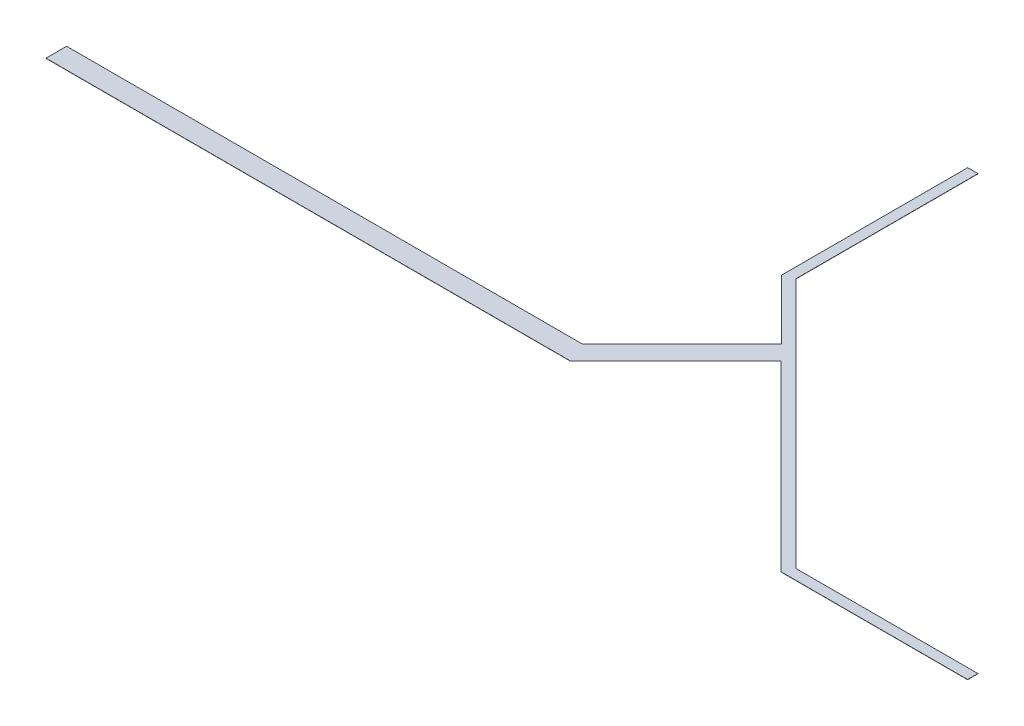
ISO-10303-21;
HEADER;
FILE_DESCRIPTION(('STEP AP214'),'2;1');
FILE_NAME('part.step','',(''),(''),'','','');
FILE_SCHEMA(('AUTOMOTIVE_DESIGN { 1 0 10303 214 1 1 1 1 }'));
ENDSEC;
DATA;
#1=APPLICATION_CONTEXT('core data for automotive mechanical design processes');
#2=APPLICATION_PROTOCOL_DEFINITION('international standard','automotive_design',2000,#1);
#3=PRODUCT_CONTEXT('',#1,'mechanical');
#4=PRODUCT('Part','Part','',(#3));
#5=PRODUCT_RELATED_PRODUCT_CATEGORY('part','',(#4));
#6=PRODUCT_DEFINITION_FORMATION('','',#4);
#7=PRODUCT_DEFINITION_CONTEXT('part definition',#1,'design');
#8=PRODUCT_DEFINITION('design','',#6,#7);
#9=PRODUCT_DEFINITION_SHAPE('','',#8);
#10=(LENGTH_UNIT() NAMED_UNIT(*) SI_UNIT(.MILLI.,.METRE.));
#11=(NAMED_UNIT(*) PLANE_ANGLE_UNIT() SI_UNIT($,.RADIAN.));
#12=(NAMED_UNIT(*) SI_UNIT($,.STERADIAN.) SOLID_ANGLE_UNIT());
#13=UNCERTAINTY_MEASURE_WITH_UNIT(LENGTH_MEASURE(1.E-05),#10,'distance_accuracy_value','');
#14=(GEOMETRIC_REPRESENTATION_CONTEXT(3) GLOBAL_UNCERTAINTY_ASSIGNED_CONTEXT((#13)) GLOBAL_UNIT_ASSIGNED_CONTEXT((#10,
#11,#12)) REPRESENTATION_CONTEXT('',''));
#15=CARTESIAN_POINT('',(0.,0.,0.));
#16=DIRECTION('',(0.,0.,1.));
#17=DIRECTION('',(1.,0.,0.));
#18=AXIS2_PLACEMENT_3D('',#15,#16,#17);
#19=CARTESIAN_POINT('',(22.4783237631845,0.015,-2.01243954632229));
#20=DIRECTION('',(0.,0.,-1.));
#21=DIRECTION('',(-1.,0.,0.));
#22=AXIS2_PLACEMENT_3D('',#19,#20,#21);
#23=PLANE('',#22);
#24=DIRECTION('',(1.,0.,0.));
#25=VECTOR('',#24,1.);
#26=CARTESIAN_POINT('',(22.4783237631845,0.005,-2.01243954632229));
#27=LINE('',#26,#25);
#28=CARTESIAN_POINT('',(22.4783237631845,0.005,-2.01243954632229));
#29=VERTEX_POINT('',#28);
#30=CARTESIAN_POINT('',(47.8933237631845,0.005,-2.01243954632229));
#31=VERTEX_POINT('',#30);
#32=EDGE_CURVE('E167',#29,#31,#27,.T.);
#33=ORIENTED_EDGE('',*,*,#32,.T.);
#34=DIRECTION('',(0.,-1.,0.));
#35=VECTOR('',#34,1.);
#36=CARTESIAN_POINT('',(47.8933237631845,0.015,-2.01243954632229));
#37=LINE('',#36,#35);
#38=CARTESIAN_POINT('',(47.8933237631845,0.015,-2.01243954632229));
#39=VERTEX_POINT('',#38);
#40=EDGE_CURVE('E11',#39,#31,#37,.T.);
#41=ORIENTED_EDGE('',*,*,#40,.F.);
#42=DIRECTION('',(1.,0.,0.));
#43=VECTOR('',#42,1.);
#44=CARTESIAN_POINT('',(22.4783237631845,0.015,-2.01243954632229));
#45=LINE('',#44,#43);
#46=CARTESIAN_POINT('',(22.4783237631845,0.015,-2.01243954632229));
#47=VERTEX_POINT('',#46);
#48=EDGE_CURVE('E193',#47,#39,#45,.T.);
#49=ORIENTED_EDGE('',*,*,#48,.F.);
#50=DIRECTION('',(0.,-1.,0.));
#51=VECTOR('',#50,1.);
#52=CARTESIAN_POINT('',(22.4783237631845,0.015,-2.01243954632229));
#53=LINE('',#52,#51);
#54=EDGE_CURVE('E163',#47,#29,#53,.T.);
#55=ORIENTED_EDGE('',*,*,#54,.T.);
#56=EDGE_LOOP('',(#33,#41,#49,#55));
#57=FACE_BOUND('',#56,.T.);
#58=ADVANCED_FACE('F35',(#57),#23,.F.);
#59=CARTESIAN_POINT('',(47.8933237631845,0.015,-2.01243954632229));
#60=DIRECTION('',(-0.707106781186549,0.,-0.707106781186546));
#61=DIRECTION('',(-0.707106781186546,0.,0.707106781186549));
#62=AXIS2_PLACEMENT_3D('',#59,#60,#61);
#63=PLANE('',#62);
#64=DIRECTION('',(0.707106781186546,0.,-0.707106781186549));
#65=VECTOR('',#64,1.);
#66=CARTESIAN_POINT('',(47.8933237631845,0.005,-2.01243954632229));
#67=LINE('',#66,#65);
#68=CARTESIAN_POINT('',(53.0092413250692,0.005,-7.12835710820697));
#69=VERTEX_POINT('',#68);
#70=EDGE_CURVE('E170',#31,#69,#67,.T.);
#71=ORIENTED_EDGE('',*,*,#70,.T.);
#72=DIRECTION('',(0.,-1.,0.));
#73=VECTOR('',#72,1.);
#74=CARTESIAN_POINT('',(53.0092413250692,0.015,-7.12835710820697));
#75=LINE('',#74,#73);
#76=CARTESIAN_POINT('',(53.0092413250692,0.015,-7.12835710820697));
#77=VERTEX_POINT('',#76);
#78=EDGE_CURVE('E43',#77,#69,#75,.T.);
#79=ORIENTED_EDGE('',*,*,#78,.F.);
#80=DIRECTION('',(0.707106781186546,0.,-0.707106781186549));
#81=VECTOR('',#80,1.);
#82=CARTESIAN_POINT('',(47.8933237631845,0.015,-2.01243954632229));
#83=LINE('',#82,#81);
#84=EDGE_CURVE('E112',#39,#77,#83,.T.);
#85=ORIENTED_EDGE('',*,*,#84,.F.);
#86=ORIENTED_EDGE('',*,*,#40,.T.);
#87=EDGE_LOOP('',(#71,#79,#85,#86));
#88=FACE_BOUND('',#87,.T.);
#89=ADVANCED_FACE('F281',(#88),#63,.F.);
#90=CARTESIAN_POINT('',(53.0092413250692,0.015,-7.12835710820697));
#91=DIRECTION('',(0.707106781186548,0.,-0.707106781186547));
#92=DIRECTION('',(-0.707106781186547,0.,-0.707106781186548));
#93=AXIS2_PLACEMENT_3D('',#90,#91,#92);
#94=PLANE('',#93);
#95=DIRECTION('',(0.707106781186547,0.,0.707106781186548));
#96=VECTOR('',#95,1.);
#97=CARTESIAN_POINT('',(53.0092413250692,0.005,-7.12835710820697));
#98=LINE('',#97,#96);
#99=CARTESIAN_POINT('',(61.8728248272426,0.005,1.73522639396643));
#100=VERTEX_POINT('',#99);
#101=EDGE_CURVE('E172',#69,#100,#98,.T.);
#102=ORIENTED_EDGE('',*,*,#101,.T.);
#103=DIRECTION('',(0.,-1.,0.));
#104=VECTOR('',#103,1.);
#105=CARTESIAN_POINT('',(61.8728248272426,0.015,1.73522639396643));
#106=LINE('',#105,#104);
#107=CARTESIAN_POINT('',(61.8728248272426,0.015,1.73522639396643));
#108=VERTEX_POINT('',#107);
#109=EDGE_CURVE('E218',#108,#100,#106,.T.);
#110=ORIENTED_EDGE('',*,*,#109,.F.);
#111=DIRECTION('',(0.707106781186547,0.,0.707106781186548));
#112=VECTOR('',#111,1.);
#113=CARTESIAN_POINT('',(53.0092413250692,0.015,-7.12835710820697));
#114=LINE('',#113,#112);
#115=EDGE_CURVE('E226',#77,#108,#114,.T.);
#116=ORIENTED_EDGE('',*,*,#115,.F.);
#117=ORIENTED_EDGE('',*,*,#78,.T.);
#118=EDGE_LOOP('',(#102,#110,#116,#117));
#119=FACE_BOUND('',#118,.T.);
#120=ADVANCED_FACE('F224',(#119),#94,.F.);
#121=CARTESIAN_POINT('',(61.8728248272426,0.015,1.73522639396643));
#122=DIRECTION('',(0.,0.,-1.));
#123=DIRECTION('',(-1.,0.,0.));
#124=AXIS2_PLACEMENT_3D('',#121,#122,#123);
#125=PLANE('',#124);
#126=DIRECTION('',(1.,0.,0.));
#127=VECTOR('',#126,1.);
#128=CARTESIAN_POINT('',(61.8728248272426,0.005,1.73522639396643));
#129=LINE('',#128,#127);
#130=CARTESIAN_POINT('',(70.9128248272426,0.005,1.73522639396641));
#131=VERTEX_POINT('',#130);
#132=EDGE_CURVE('E174',#100,#131,#129,.T.);
#133=ORIENTED_EDGE('',*,*,#132,.T.);
#134=DIRECTION('',(0.,-1.,0.));
#135=VECTOR('',#134,1.);
#136=CARTESIAN_POINT('',(70.9128248272426,0.015,1.73522639396641));
#137=LINE('',#136,#135);
#138=CARTESIAN_POINT('',(70.9128248272426,0.015,1.73522639396641));
#139=VERTEX_POINT('',#138);
#140=EDGE_CURVE('E215',#139,#131,#137,.T.);
#141=ORIENTED_EDGE('',*,*,#140,.F.);
#142=DIRECTION('',(1.,0.,0.));
#143=VECTOR('',#142,1.);
#144=CARTESIAN_POINT('',(61.8728248272426,0.015,1.73522639396643));
#145=LINE('',#144,#143);
#146=EDGE_CURVE('E244',#108,#139,#145,.T.);
#147=ORIENTED_EDGE('',*,*,#146,.F.);
#148=ORIENTED_EDGE('',*,*,#109,.T.);
#149=EDGE_LOOP('',(#133,#141,#147,#148));
#150=FACE_BOUND('',#149,.T.);
#151=ADVANCED_FACE('F235',(#150),#125,.F.);
#152=CARTESIAN_POINT('',(70.9128248272426,0.015,1.73522639396641));
#153=DIRECTION('',(-1.,0.,0.));
#154=DIRECTION('',(0.,0.,1.));
#155=AXIS2_PLACEMENT_3D('',#152,#153,#154);
#156=PLANE('',#155);
#157=DIRECTION('',(0.,0.,-1.));
#158=VECTOR('',#157,1.);
#159=CARTESIAN_POINT('',(70.9128248272426,0.005,1.73522639396641));
#160=LINE('',#159,#158);
#161=CARTESIAN_POINT('',(70.9128248272426,0.005,1.23522639396641));
#162=VERTEX_POINT('',#161);
#163=EDGE_CURVE('E176',#131,#162,#160,.T.);
#164=ORIENTED_EDGE('',*,*,#163,.T.);
#165=DIRECTION('',(0.,-1.,0.));
#166=VECTOR('',#165,1.);
#167=CARTESIAN_POINT('',(70.9128248272426,0.015,1.23522639396641));
#168=LINE('',#167,#166);
#169=CARTESIAN_POINT('',(70.9128248272426,0.015,1.23522639396641));
#170=VERTEX_POINT('',#169);
#171=EDGE_CURVE('E212',#170,#162,#168,.T.);
#172=ORIENTED_EDGE('',*,*,#171,.F.);
#173=DIRECTION('',(0.,0.,-1.));
#174=VECTOR('',#173,1.);
#175=CARTESIAN_POINT('',(70.9128248272426,0.015,1.73522639396641));
#176=LINE('',#175,#174);
#177=EDGE_CURVE('E241',#139,#170,#176,.T.);
#178=ORIENTED_EDGE('',*,*,#177,.F.);
#179=ORIENTED_EDGE('',*,*,#140,.T.);
#180=EDGE_LOOP('',(#164,#172,#178,#179));
#181=FACE_BOUND('',#180,.T.);
#182=ADVANCED_FACE('F239',(#181),#156,.F.);
#183=CARTESIAN_POINT('',(70.9128248272426,0.015,1.23522639396641));
#184=DIRECTION('',(0.,0.,1.));
#185=DIRECTION('',(1.,0.,0.));
#186=AXIS2_PLACEMENT_3D('',#183,#184,#185);
#187=PLANE('',#186);
#188=DIRECTION('',(-1.,0.,0.));
#189=VECTOR('',#188,1.);
#190=CARTESIAN_POINT('',(70.9128248272426,0.005,1.23522639396641));
#191=LINE('',#190,#189);
#192=CARTESIAN_POINT('',(62.0828248272426,0.005,1.23522639396642));
#193=VERTEX_POINT('',#192);
#194=EDGE_CURVE('E178',#162,#193,#191,.T.);
#195=ORIENTED_EDGE('',*,*,#194,.T.);
#196=DIRECTION('',(0.,-1.,0.));
#197=VECTOR('',#196,1.);
#198=CARTESIAN_POINT('',(62.0828248272426,0.015,1.23522639396642));
#199=LINE('',#198,#197);
#200=CARTESIAN_POINT('',(62.0828248272426,0.015,1.23522639396642));
#201=VERTEX_POINT('',#200);
#202=EDGE_CURVE('E209',#201,#193,#199,.T.);
#203=ORIENTED_EDGE('',*,*,#202,.F.);
#204=DIRECTION('',(-1.,0.,0.));
#205=VECTOR('',#204,1.);
#206=CARTESIAN_POINT('',(70.9128248272426,0.015,1.23522639396641));
#207=LINE('',#206,#205);
#208=EDGE_CURVE('E243',#170,#201,#207,.T.);
#209=ORIENTED_EDGE('',*,*,#208,.F.);
#210=ORIENTED_EDGE('',*,*,#171,.T.);
#211=EDGE_LOOP('',(#195,#203,#209,#210));
#212=FACE_BOUND('',#211,.T.);
#213=ADVANCED_FACE('F294',(#212),#187,.F.);
#214=CARTESIAN_POINT('',(49.9228674114475,0.015,-10.9299034612557));
#215=DIRECTION('',(-0.707257123013171,0.,0.70695640738813));
#216=DIRECTION('',(0.70695640738813,0.,0.707257123013171));
#217=AXIS2_PLACEMENT_3D('',#214,#215,#216);
#218=PLANE('',#217);
#219=DIRECTION('',(-0.70695640738813,0.,-0.707257123013171));
#220=VECTOR('',#219,1.);
#221=CARTESIAN_POINT('',(49.9228674114475,0.005,-10.9299034612557));
#222=LINE('',#221,#220);
#223=CARTESIAN_POINT('',(49.9228674114475,0.005,-10.9299034612557));
#224=VERTEX_POINT('',#223);
#225=EDGE_CURVE('E180',#193,#224,#222,.T.);
#226=ORIENTED_EDGE('',*,*,#225,.T.);
#227=DIRECTION('',(0.,-1.,0.));
#228=VECTOR('',#227,1.);
#229=CARTESIAN_POINT('',(49.9228674114475,0.015,-10.9299034612557));
#230=LINE('',#229,#228);
#231=CARTESIAN_POINT('',(49.9228674114475,0.015,-10.9299034612557));
#232=VERTEX_POINT('',#231);
#233=EDGE_CURVE('E206',#232,#224,#230,.T.);
#234=ORIENTED_EDGE('',*,*,#233,.F.);
#235=DIRECTION('',(-0.70695640738813,0.,-0.707257123013171));
#236=VECTOR('',#235,1.);
#237=CARTESIAN_POINT('',(49.9228674114475,0.015,-10.9299034612557));
#238=LINE('',#237,#236);
#239=EDGE_CURVE('E246',#201,#232,#238,.T.);
#240=ORIENTED_EDGE('',*,*,#239,.F.);
#241=ORIENTED_EDGE('',*,*,#202,.T.);
#242=EDGE_LOOP('',(#226,#234,#240,#241));
#243=FACE_BOUND('',#242,.T.);
#244=ADVANCED_FACE('F297',(#243),#218,.F.);
#245=CARTESIAN_POINT('',(49.9228674114475,0.015,-19.7599034612557));
#246=DIRECTION('',(-1.,0.,0.));
#247=DIRECTION('',(0.,0.,1.));
#248=AXIS2_PLACEMENT_3D('',#245,#246,#247);
#249=PLANE('',#248);
#250=DIRECTION('',(0.,0.,-1.));
#251=VECTOR('',#250,1.);
#252=CARTESIAN_POINT('',(49.9228674114475,0.005,-19.7599034612557));
#253=LINE('',#252,#251);
#254=CARTESIAN_POINT('',(49.9228674114475,0.005,-19.7599034612557));
#255=VERTEX_POINT('',#254);
#256=EDGE_CURVE('E182',#224,#255,#253,.T.);
#257=ORIENTED_EDGE('',*,*,#256,.T.);
#258=DIRECTION('',(0.,-1.,0.));
#259=VECTOR('',#258,1.);
#260=CARTESIAN_POINT('',(49.9228674114475,0.015,-19.7599034612557));
#261=LINE('',#260,#259);
#262=CARTESIAN_POINT('',(49.9228674114475,0.015,-19.7599034612557));
#263=VERTEX_POINT('',#262);
#264=EDGE_CURVE('E203',#263,#255,#261,.T.);
#265=ORIENTED_EDGE('',*,*,#264,.F.);
#266=DIRECTION('',(0.,0.,-1.));
#267=VECTOR('',#266,1.);
#268=CARTESIAN_POINT('',(49.9228674114475,0.015,-19.7599034612557));
#269=LINE('',#268,#267);
#270=EDGE_CURVE('E252',#232,#263,#269,.T.);
#271=ORIENTED_EDGE('',*,*,#270,.F.);
#272=ORIENTED_EDGE('',*,*,#233,.T.);
#273=EDGE_LOOP('',(#257,#265,#271,#272));
#274=FACE_BOUND('',#273,.T.);
#275=ADVANCED_FACE('F301',(#274),#249,.F.);
#276=CARTESIAN_POINT('',(49.4228674114475,0.015,-19.7599034612557));
#277=DIRECTION('',(0.,0.,1.));
#278=DIRECTION('',(1.,0.,0.));
#279=AXIS2_PLACEMENT_3D('',#276,#277,#278);
#280=PLANE('',#279);
#281=DIRECTION('',(-1.,0.,0.));
#282=VECTOR('',#281,1.);
#283=CARTESIAN_POINT('',(49.4228674114475,0.005,-19.7599034612557));
#284=LINE('',#283,#282);
#285=CARTESIAN_POINT('',(49.4228674114475,0.005,-19.7599034612557));
#286=VERTEX_POINT('',#285);
#287=EDGE_CURVE('E184',#255,#286,#284,.T.);
#288=ORIENTED_EDGE('',*,*,#287,.T.);
#289=DIRECTION('',(0.,-1.,0.));
#290=VECTOR('',#289,1.);
#291=CARTESIAN_POINT('',(49.4228674114475,0.015,-19.7599034612557));
#292=LINE('',#291,#290);
#293=CARTESIAN_POINT('',(49.4228674114475,0.015,-19.7599034612557));
#294=VERTEX_POINT('',#293);
#295=EDGE_CURVE('E200',#294,#286,#292,.T.);
#296=ORIENTED_EDGE('',*,*,#295,.F.);
#297=DIRECTION('',(-1.,0.,0.));
#298=VECTOR('',#297,1.);
#299=CARTESIAN_POINT('',(49.4228674114475,0.015,-19.7599034612557));
#300=LINE('',#299,#298);
#301=EDGE_CURVE('E254',#263,#294,#300,.T.);
#302=ORIENTED_EDGE('',*,*,#301,.F.);
#303=ORIENTED_EDGE('',*,*,#264,.T.);
#304=EDGE_LOOP('',(#288,#296,#302,#303));
#305=FACE_BOUND('',#304,.T.);
#306=ADVANCED_FACE('F305',(#305),#280,.F.);
#307=CARTESIAN_POINT('',(49.4228674114475,0.015,-10.7199034612557));
#308=DIRECTION('',(1.,0.,0.));
#309=DIRECTION('',(0.,0.,-1.));
#310=AXIS2_PLACEMENT_3D('',#307,#308,#309);
#311=PLANE('',#310);
#312=DIRECTION('',(0.,0.,1.));
#313=VECTOR('',#312,1.);
#314=CARTESIAN_POINT('',(49.4228674114475,0.005,-10.7199034612557));
#315=LINE('',#314,#313);
#316=CARTESIAN_POINT('',(49.4228674114475,0.005,-10.7199034612557));
#317=VERTEX_POINT('',#316);
#318=EDGE_CURVE('E186',#286,#317,#315,.T.);
#319=ORIENTED_EDGE('',*,*,#318,.T.);
#320=DIRECTION('',(0.,-1.,0.));
#321=VECTOR('',#320,1.);
#322=CARTESIAN_POINT('',(49.4228674114475,0.015,-10.7199034612557));
#323=LINE('',#322,#321);
#324=CARTESIAN_POINT('',(49.4228674114475,0.015,-10.7199034612557));
#325=VERTEX_POINT('',#324);
#326=EDGE_CURVE('E197',#325,#317,#323,.T.);
#327=ORIENTED_EDGE('',*,*,#326,.F.);
#328=DIRECTION('',(0.,0.,1.));
#329=VECTOR('',#328,1.);
#330=CARTESIAN_POINT('',(49.4228674114475,0.015,-10.7199034612557));
#331=LINE('',#330,#329);
#332=EDGE_CURVE('E256',#294,#325,#331,.T.);
#333=ORIENTED_EDGE('',*,*,#332,.F.);
#334=ORIENTED_EDGE('',*,*,#295,.T.);
#335=EDGE_LOOP('',(#319,#327,#333,#334));
#336=FACE_BOUND('',#335,.T.);
#337=ADVANCED_FACE('F262',(#336),#311,.F.);
#338=CARTESIAN_POINT('',(52.3043275447827,0.015,-7.83844332792049));
#339=DIRECTION('',(0.707106781186548,0.,-0.707106781186547));
#340=DIRECTION('',(-0.707106781186547,0.,-0.707106781186548));
#341=AXIS2_PLACEMENT_3D('',#338,#339,#340);
#342=PLANE('',#341);
#343=DIRECTION('',(0.707106781186547,0.,0.707106781186548));
#344=VECTOR('',#343,1.);
#345=CARTESIAN_POINT('',(52.3043275447827,0.005,-7.83844332792049));
#346=LINE('',#345,#344);
#347=CARTESIAN_POINT('',(52.3043275447827,0.005,-7.83844332792049));
#348=VERTEX_POINT('',#347);
#349=EDGE_CURVE('E188',#317,#348,#346,.T.);
#350=ORIENTED_EDGE('',*,*,#349,.T.);
#351=DIRECTION('',(0.,-1.,0.));
#352=VECTOR('',#351,1.);
#353=CARTESIAN_POINT('',(52.3043275447827,0.015,-7.83844332792049));
#354=LINE('',#353,#352);
#355=CARTESIAN_POINT('',(52.3043275447827,0.015,-7.83844332792049));
#356=VERTEX_POINT('',#355);
#357=EDGE_CURVE('E158',#356,#348,#354,.T.);
#358=ORIENTED_EDGE('',*,*,#357,.F.);
#359=DIRECTION('',(0.707106781186547,0.,0.707106781186548));
#360=VECTOR('',#359,1.);
#361=CARTESIAN_POINT('',(52.3043275447827,0.015,-7.83844332792049));
#362=LINE('',#361,#360);
#363=EDGE_CURVE('E149',#325,#356,#362,.T.);
#364=ORIENTED_EDGE('',*,*,#363,.F.);
#365=ORIENTED_EDGE('',*,*,#326,.T.);
#366=EDGE_LOOP('',(#350,#358,#364,#365));
#367=FACE_BOUND('',#366,.T.);
#368=ADVANCED_FACE('F266',(#367),#342,.F.);
#369=CARTESIAN_POINT('',(47.4783237631845,0.015,-3.01243954632229));
#370=DIRECTION('',(0.707106781186549,0.,0.707106781186546));
#371=DIRECTION('',(0.707106781186546,0.,-0.707106781186549));
#372=AXIS2_PLACEMENT_3D('',#369,#370,#371);
#373=PLANE('',#372);
#374=DIRECTION('',(-0.707106781186546,0.,0.707106781186549));
#375=VECTOR('',#374,1.);
#376=CARTESIAN_POINT('',(47.4783237631845,0.005,-3.01243954632229));
#377=LINE('',#376,#375);
#378=CARTESIAN_POINT('',(47.4783237631845,0.005,-3.01243954632229));
#379=VERTEX_POINT('',#378);
#380=EDGE_CURVE('E157',#348,#379,#377,.T.);
#381=ORIENTED_EDGE('',*,*,#380,.T.);
#382=DIRECTION('',(0.,-1.,0.));
#383=VECTOR('',#382,1.);
#384=CARTESIAN_POINT('',(47.4783237631845,0.015,-3.01243954632229));
#385=LINE('',#384,#383);
#386=CARTESIAN_POINT('',(47.4783237631845,0.015,-3.01243954632229));
#387=VERTEX_POINT('',#386);
#388=EDGE_CURVE('E154',#387,#379,#385,.T.);
#389=ORIENTED_EDGE('',*,*,#388,.F.);
#390=DIRECTION('',(-0.707106781186546,0.,0.707106781186549));
#391=VECTOR('',#390,1.);
#392=CARTESIAN_POINT('',(47.4783237631845,0.015,-3.01243954632229));
#393=LINE('',#392,#391);
#394=EDGE_CURVE('E143',#356,#387,#393,.T.);
#395=ORIENTED_EDGE('',*,*,#394,.F.);
#396=ORIENTED_EDGE('',*,*,#357,.T.);
#397=EDGE_LOOP('',(#381,#389,#395,#396));
#398=FACE_BOUND('',#397,.T.);
#399=ADVANCED_FACE('F155',(#398),#373,.F.);
#400=CARTESIAN_POINT('',(22.4783237631845,0.015,-3.01243954632229));
#401=DIRECTION('',(0.,0.,1.));
#402=DIRECTION('',(1.,0.,0.));
#403=AXIS2_PLACEMENT_3D('',#400,#401,#402);
#404=PLANE('',#403);
#405=DIRECTION('',(-1.,0.,0.));
#406=VECTOR('',#405,1.);
#407=CARTESIAN_POINT('',(22.4783237631845,0.005,-3.01243954632229));
#408=LINE('',#407,#406);
#409=CARTESIAN_POINT('',(22.4783237631845,0.005,-3.01243954632229));
#410=VERTEX_POINT('',#409);
#411=EDGE_CURVE('E98',#379,#410,#408,.T.);
#412=ORIENTED_EDGE('',*,*,#411,.T.);
#413=DIRECTION('',(0.,-1.,0.));
#414=VECTOR('',#413,1.);
#415=CARTESIAN_POINT('',(22.4783237631845,0.015,-3.01243954632229));
#416=LINE('',#415,#414);
#417=CARTESIAN_POINT('',(22.4783237631845,0.015,-3.01243954632229));
#418=VERTEX_POINT('',#417);
#419=EDGE_CURVE('E159',#418,#410,#416,.T.);
#420=ORIENTED_EDGE('',*,*,#419,.F.);
#421=DIRECTION('',(-1.,0.,0.));
#422=VECTOR('',#421,1.);
#423=CARTESIAN_POINT('',(22.4783237631845,0.015,-3.01243954632229));
#424=LINE('',#423,#422);
#425=EDGE_CURVE('E147',#387,#418,#424,.T.);
#426=ORIENTED_EDGE('',*,*,#425,.F.);
#427=ORIENTED_EDGE('',*,*,#388,.T.);
#428=EDGE_LOOP('',(#412,#420,#426,#427));
#429=FACE_BOUND('',#428,.T.);
#430=ADVANCED_FACE('F161',(#429),#404,.F.);
#431=CARTESIAN_POINT('',(22.4783237631845,0.015,-2.01243954632229));
#432=DIRECTION('',(1.,0.,0.));
#433=DIRECTION('',(0.,0.,-1.));
#434=AXIS2_PLACEMENT_3D('',#431,#432,#433);
#435=PLANE('',#434);
#436=DIRECTION('',(0.,0.,1.));
#437=VECTOR('',#436,1.);
#438=CARTESIAN_POINT('',(22.4783237631845,0.005,-2.01243954632229));
#439=LINE('',#438,#437);
#440=EDGE_CURVE('E104',#410,#29,#439,.T.);
#441=ORIENTED_EDGE('',*,*,#440,.T.);
#442=ORIENTED_EDGE('',*,*,#54,.F.);
#443=DIRECTION('',(0.,0.,1.));
#444=VECTOR('',#443,1.);
#445=CARTESIAN_POINT('',(22.4783237631845,0.015,-2.01243954632229));
#446=LINE('',#445,#444);
#447=EDGE_CURVE('E51',#418,#47,#446,.T.);
#448=ORIENTED_EDGE('',*,*,#447,.F.);
#449=ORIENTED_EDGE('',*,*,#419,.T.);
#450=EDGE_LOOP('',(#441,#442,#448,#449));
#451=FACE_BOUND('',#450,.T.);
#452=ADVANCED_FACE('F270',(#451),#435,.F.);
#453=CARTESIAN_POINT('',(22.4783237631845,0.015,-2.01243954632229));
#454=DIRECTION('',(0.,1.,0.));
#455=DIRECTION('',(0.,0.,1.));
#456=AXIS2_PLACEMENT_3D('',#453,#454,#455);
#457=PLANE('',#456);
#458=ORIENTED_EDGE('',*,*,#48,.T.);
#459=ORIENTED_EDGE('',*,*,#84,.T.);
#460=ORIENTED_EDGE('',*,*,#115,.T.);
#461=ORIENTED_EDGE('',*,*,#146,.T.);
#462=ORIENTED_EDGE('',*,*,#177,.T.);
#463=ORIENTED_EDGE('',*,*,#208,.T.);
#464=ORIENTED_EDGE('',*,*,#239,.T.);
#465=ORIENTED_EDGE('',*,*,#270,.T.);
#466=ORIENTED_EDGE('',*,*,#301,.T.);
#467=ORIENTED_EDGE('',*,*,#332,.T.);
#468=ORIENTED_EDGE('',*,*,#363,.T.);
#469=ORIENTED_EDGE('',*,*,#394,.T.);
#470=ORIENTED_EDGE('',*,*,#425,.T.);
#471=ORIENTED_EDGE('',*,*,#447,.T.);
#472=EDGE_LOOP('',(#458,#459,#460,#461,#462,#463,#464,#465,#466,#467,#468,#469,#470,#471));
#473=FACE_BOUND('',#472,.T.);
#474=ADVANCED_FACE('F145',(#473),#457,.T.);
#475=CARTESIAN_POINT('',(22.4783237631845,0.005,-2.01243954632229));
#476=DIRECTION('',(0.,1.,0.));
#477=DIRECTION('',(0.,0.,1.));
#478=AXIS2_PLACEMENT_3D('',#475,#476,#477);
#479=PLANE('',#478);
#480=ORIENTED_EDGE('',*,*,#32,.F.);
#481=ORIENTED_EDGE('',*,*,#440,.F.);
#482=ORIENTED_EDGE('',*,*,#411,.F.);
#483=ORIENTED_EDGE('',*,*,#380,.F.);
#484=ORIENTED_EDGE('',*,*,#349,.F.);
#485=ORIENTED_EDGE('',*,*,#318,.F.);
#486=ORIENTED_EDGE('',*,*,#287,.F.);
#487=ORIENTED_EDGE('',*,*,#256,.F.);
#488=ORIENTED_EDGE('',*,*,#225,.F.);
#489=ORIENTED_EDGE('',*,*,#194,.F.);
#490=ORIENTED_EDGE('',*,*,#163,.F.);
#491=ORIENTED_EDGE('',*,*,#132,.F.);
#492=ORIENTED_EDGE('',*,*,#101,.F.);
#493=ORIENTED_EDGE('',*,*,#70,.F.);
#494=EDGE_LOOP('',(#480,#481,#482,#483,#484,#485,#486,#487,#488,#489,#490,#491,#492,#493));
#495=FACE_BOUND('',#494,.T.);
#496=ADVANCED_FACE('F230',(#495),#479,.F.);
#497=CLOSED_SHELL('',(#58,#89,#120,#151,#182,#213,#244,#275,#306,#337,#368,#399,#430,#452,#474,#496));
#498=MANIFOLD_SOLID_BREP('B2',#497);
#499=ADVANCED_BREP_SHAPE_REPRESENTATION('',(#18,#498),#14);
#500=SHAPE_DEFINITION_REPRESENTATION(#9,#499);
ENDSEC;
END-ISO-10303-21;
